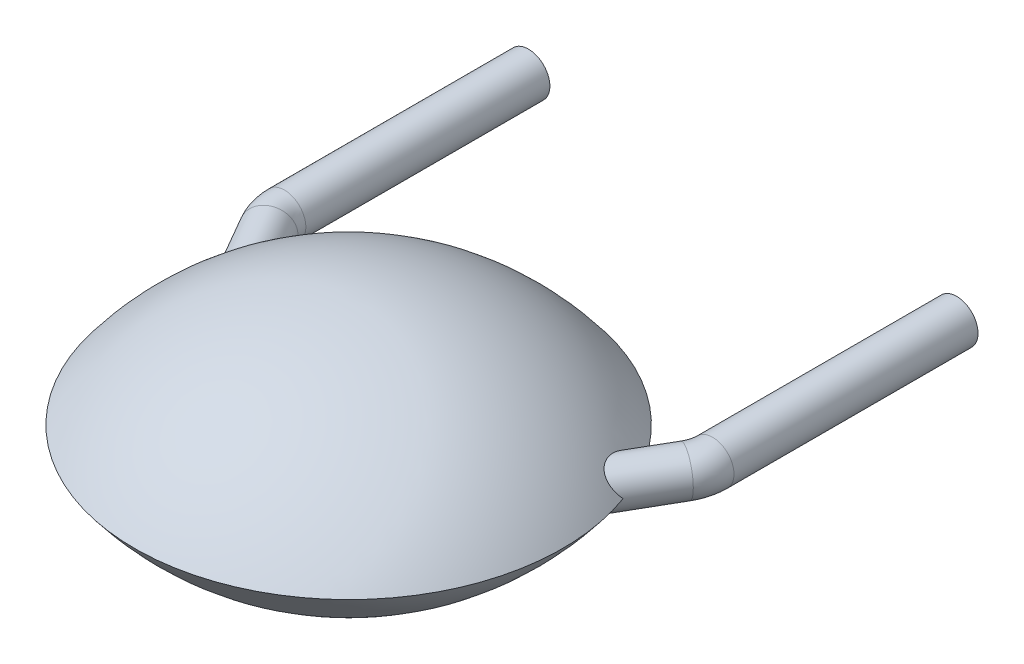
ISO-10303-21;
HEADER;
FILE_DESCRIPTION(('STEP AP214'),'2;1');
FILE_NAME('part.step','',(''),(''),'','','');
FILE_SCHEMA(('AUTOMOTIVE_DESIGN { 1 0 10303 214 1 1 1 1 }'));
ENDSEC;
DATA;
#1=APPLICATION_CONTEXT('core data for automotive mechanical design processes');
#2=APPLICATION_PROTOCOL_DEFINITION('international standard','automotive_design',2000,#1);
#3=PRODUCT_CONTEXT('',#1,'mechanical');
#4=PRODUCT('Part','Part','',(#3));
#5=PRODUCT_RELATED_PRODUCT_CATEGORY('part','',(#4));
#6=PRODUCT_DEFINITION_FORMATION('','',#4);
#7=PRODUCT_DEFINITION_CONTEXT('part definition',#1,'design');
#8=PRODUCT_DEFINITION('design','',#6,#7);
#9=PRODUCT_DEFINITION_SHAPE('','',#8);
#10=(LENGTH_UNIT() NAMED_UNIT(*) SI_UNIT(.MILLI.,.METRE.));
#11=(NAMED_UNIT(*) PLANE_ANGLE_UNIT() SI_UNIT($,.RADIAN.));
#12=(NAMED_UNIT(*) SI_UNIT($,.STERADIAN.) SOLID_ANGLE_UNIT());
#13=UNCERTAINTY_MEASURE_WITH_UNIT(LENGTH_MEASURE(1.E-05),#10,'distance_accuracy_value','');
#14=(GEOMETRIC_REPRESENTATION_CONTEXT(3) GLOBAL_UNCERTAINTY_ASSIGNED_CONTEXT((#13)) GLOBAL_UNIT_ASSIGNED_CONTEXT((#10,
#11,#12)) REPRESENTATION_CONTEXT('',''));
#15=CARTESIAN_POINT('',(0.,0.,0.));
#16=DIRECTION('',(0.,0.,1.));
#17=DIRECTION('',(1.,0.,0.));
#18=AXIS2_PLACEMENT_3D('',#15,#16,#17);
#19=CARTESIAN_POINT('',(-0.255,-0.25,-2.));
#20=DIRECTION('',(0.,0.,-1.));
#21=DIRECTION('',(0.,1.,0.));
#22=AXIS2_PLACEMENT_3D('',#19,#20,#21);
#23=PLANE('',#22);
#24=CARTESIAN_POINT('',(0.,1.26567051110527E-13,-2.));
#25=DIRECTION('',(0.,0.,-1.));
#26=DIRECTION('',(-1.,0.,0.));
#27=AXIS2_PLACEMENT_3D('',#24,#25,#26);
#28=CIRCLE('',#27,0.249999999999979);
#29=CARTESIAN_POINT('',(-0.249999999999979,1.26567051110527E-13,-2.));
#30=VERTEX_POINT('',#29);
#31=EDGE_CURVE('E22',#30,#30,#28,.F.);
#32=ORIENTED_EDGE('',*,*,#31,.F.);
#33=EDGE_LOOP('',(#32));
#34=FACE_BOUND('',#33,.T.);
#35=ADVANCED_FACE('F17',(#34),#23,.T.);
#36=CARTESIAN_POINT('',(5.255,0.25,-2.));
#37=DIRECTION('',(0.,0.,-1.));
#38=DIRECTION('',(0.,-1.,0.));
#39=AXIS2_PLACEMENT_3D('',#36,#37,#38);
#40=PLANE('',#39);
#41=CARTESIAN_POINT('',(5.,-1.26567051110527E-13,-2.));
#42=DIRECTION('',(0.,0.,-1.));
#43=DIRECTION('',(-1.,0.,0.));
#44=AXIS2_PLACEMENT_3D('',#41,#42,#43);
#45=CIRCLE('',#44,0.249999999999979);
#46=CARTESIAN_POINT('',(4.75000000000002,-1.26567051110527E-13,-2.));
#47=VERTEX_POINT('',#46);
#48=EDGE_CURVE('E72',#47,#47,#45,.F.);
#49=ORIENTED_EDGE('',*,*,#48,.F.);
#50=EDGE_LOOP('',(#49));
#51=FACE_BOUND('',#50,.T.);
#52=ADVANCED_FACE('F104',(#51),#40,.T.);
#53=CARTESIAN_POINT('',(0.,1.26567051110527E-13,0.85));
#54=DIRECTION('',(0.,0.,-1.));
#55=DIRECTION('',(-1.,0.,0.));
#56=AXIS2_PLACEMENT_3D('',#53,#54,#55);
#57=CYLINDRICAL_SURFACE('',#56,0.249999999999979);
#58=CARTESIAN_POINT('',(0.,1.26783891545024E-13,0.85));
#59=DIRECTION('',(0.,0.,-1.));
#60=DIRECTION('',(-1.,0.,0.));
#61=AXIS2_PLACEMENT_3D('',#58,#59,#60);
#62=CIRCLE('',#61,0.249999999999979);
#63=CARTESIAN_POINT('',(-0.249999999999979,1.26783891545024E-13,0.85));
#64=VERTEX_POINT('',#63);
#65=EDGE_CURVE('E70',#64,#64,#62,.T.);
#66=ORIENTED_EDGE('',*,*,#65,.T.);
#67=EDGE_LOOP('',(#66));
#68=FACE_BOUND('',#67,.T.);
#69=ORIENTED_EDGE('',*,*,#31,.T.);
#70=EDGE_LOOP('',(#69));
#71=FACE_BOUND('',#70,.T.);
#72=ADVANCED_FACE('F101',(#68,#71),#57,.T.);
#73=CARTESIAN_POINT('',(5.,-1.26567051110527E-13,0.85));
#74=DIRECTION('',(0.,0.,-1.));
#75=DIRECTION('',(-1.,0.,0.));
#76=AXIS2_PLACEMENT_3D('',#73,#74,#75);
#77=CYLINDRICAL_SURFACE('',#76,0.249999999999979);
#78=CARTESIAN_POINT('',(5.,-1.26567051110527E-13,0.85));
#79=DIRECTION('',(0.,0.,-1.));
#80=DIRECTION('',(-1.,0.,0.));
#81=AXIS2_PLACEMENT_3D('',#78,#79,#80);
#82=CIRCLE('',#81,0.249999999999979);
#83=CARTESIAN_POINT('',(5.24999999999998,-1.26567051110527E-13,0.85));
#84=VERTEX_POINT('',#83);
#85=EDGE_CURVE('E67',#84,#84,#82,.T.);
#86=ORIENTED_EDGE('',*,*,#85,.T.);
#87=EDGE_LOOP('',(#86));
#88=FACE_BOUND('',#87,.T.);
#89=ORIENTED_EDGE('',*,*,#48,.T.);
#90=EDGE_LOOP('',(#89));
#91=FACE_BOUND('',#90,.T.);
#92=ADVANCED_FACE('F143',(#88,#91),#77,.T.);
#93=CARTESIAN_POINT('',(0.499999999998368,1.26783891545024E-13,0.85));
#94=DIRECTION('',(0.,1.,0.));
#95=DIRECTION('',(0.,0.,1.));
#96=AXIS2_PLACEMENT_3D('',#93,#94,#95);
#97=TOROIDAL_SURFACE('',#96,0.499999999998368,0.249999999999979);
#98=CARTESIAN_POINT('',(0.0669872981077983,1.41637461308075E-13,1.10000000000003));
#99=DIRECTION('',(0.50000000000003,-1.46384386899602E-13,0.866025403784421));
#100=DIRECTION('',(0.866025403784421,0.,-0.50000000000003));
#101=AXIS2_PLACEMENT_3D('',#98,#99,#100);
#102=CIRCLE('',#101,0.24999999999994);
#103=CARTESIAN_POINT('',(-0.14951905283789,1.49064246189615E-13,1.22500000000028));
#104=VERTEX_POINT('',#103);
#105=EDGE_CURVE('E64',#104,#104,#102,.T.);
#106=CARTESIAN_POINT('',(0.499999999998368,1.26783891545024E-13,0.85));
#107=DIRECTION('',(0.,1.,0.));
#108=DIRECTION('',(0.,0.,1.));
#109=AXIS2_PLACEMENT_3D('',#106,#107,#108);
#110=CIRCLE('',#109,0.749999999998347);
#111=EDGE_CURVE('',#64,#104,#110,.T.);
#112=ORIENTED_EDGE('',*,*,#65,.F.);
#113=ORIENTED_EDGE('',*,*,#105,.F.);
#114=ORIENTED_EDGE('',*,*,#111,.T.);
#115=ORIENTED_EDGE('',*,*,#111,.F.);
#116=EDGE_LOOP('',(#112,#114,#113,#115));
#117=FACE_BOUND('',#116,.T.);
#118=ADVANCED_FACE('F136',(#117),#97,.T.);
#119=CARTESIAN_POINT('',(4.50000000000283,-1.26567051110527E-13,0.85));
#120=DIRECTION('',(0.,-1.,0.));
#121=DIRECTION('',(0.,0.,-1.));
#122=AXIS2_PLACEMENT_3D('',#119,#120,#121);
#123=TOROIDAL_SURFACE('',#122,0.499999999997168,0.249999999999979);
#124=CARTESIAN_POINT('',(4.933012701892,0.,1.1));
#125=DIRECTION('',(-0.49999999999981,0.,0.866025403784548));
#126=DIRECTION('',(0.866025403784548,0.,0.49999999999981));
#127=AXIS2_PLACEMENT_3D('',#124,#125,#126);
#128=CIRCLE('',#127,0.249999999999994);
#129=CARTESIAN_POINT('',(5.14951905283755,0.,1.22500000000055));
#130=VERTEX_POINT('',#129);
#131=EDGE_CURVE('E61',#130,#130,#128,.T.);
#132=CARTESIAN_POINT('',(4.50000000000283,-1.26567051110527E-13,0.85));
#133=DIRECTION('',(0.,-1.,0.));
#134=DIRECTION('',(0.,0.,-1.));
#135=AXIS2_PLACEMENT_3D('',#132,#133,#134);
#136=CIRCLE('',#135,0.749999999997148);
#137=EDGE_CURVE('',#84,#130,#136,.T.);
#138=ORIENTED_EDGE('',*,*,#85,.F.);
#139=ORIENTED_EDGE('',*,*,#131,.F.);
#140=ORIENTED_EDGE('',*,*,#137,.T.);
#141=ORIENTED_EDGE('',*,*,#137,.F.);
#142=EDGE_LOOP('',(#138,#140,#139,#141));
#143=FACE_BOUND('',#142,.T.);
#144=ADVANCED_FACE('F130',(#143),#123,.T.);
#145=CARTESIAN_POINT('',(0.435698502092075,-1.66316613259276E-13,1.7386265386199));
#146=DIRECTION('',(-0.499999999999414,2.61429800100165E-13,-0.866025403784777));
#147=DIRECTION('',(-0.866025403784777,0.,0.499999999999414));
#148=AXIS2_PLACEMENT_3D('',#145,#146,#147);
#149=CYLINDRICAL_SURFACE('',#148,0.249999999999963);
#150=CARTESIAN_POINT('',(0.420502910737576,2.43781572211934E-13,1.2123070023423));
#151=CARTESIAN_POINT('',(0.427296219715295,0.0162845767891927,1.22412882817289));
#152=CARTESIAN_POINT('',(0.433049588219869,0.0319882813711467,1.23721348943219));
#153=CARTESIAN_POINT('',(0.442658773689037,0.0620392097038021,1.26534862328763));
#154=CARTESIAN_POINT('',(0.446523142303179,0.0763923045999827,1.28038983885689));
#155=CARTESIAN_POINT('',(0.453928152226553,0.109693849902198,1.3189348092324));
#156=CARTESIAN_POINT('',(0.456581447593014,0.127892474357019,1.34325424188633));
#157=CARTESIAN_POINT('',(0.458776711517447,0.161180755556295,1.39420875338534));
#158=CARTESIAN_POINT('',(0.458303433790067,0.176254807333498,1.42085455331447));
#159=CARTESIAN_POINT('',(0.454248144565577,0.202948915781051,1.47589945233532));
#160=CARTESIAN_POINT('',(0.450638190432433,0.21453666265224,1.5043121737824));
#161=CARTESIAN_POINT('',(0.440001022368547,0.233378826887958,1.56187444991464));
#162=CARTESIAN_POINT('',(0.432990228372812,0.240653696416607,1.59101983248939));
#163=CARTESIAN_POINT('',(0.419481002436585,0.247301591775329,1.63401576710726));
#164=CARTESIAN_POINT('',(0.414565196264359,0.248813772338325,1.64804143540743));
#165=CARTESIAN_POINT('',(0.403595252563461,0.250247014804036,1.67573885531674));
#166=CARTESIAN_POINT('',(0.397542064064095,0.250169397440489,1.68941089125316));
#167=CARTESIAN_POINT('',(0.385482198479669,0.248292412490526,1.7133143417489));
#168=CARTESIAN_POINT('',(0.379707313104238,0.246839735955416,1.72368788024459));
#169=CARTESIAN_POINT('',(0.367269965621471,0.242488214692803,1.74356970929103));
#170=CARTESIAN_POINT('',(0.360609026280383,0.239591828164937,1.75307943821868));
#171=CARTESIAN_POINT('',(0.348030715442077,0.233018863170264,1.76873902638242));
#172=CARTESIAN_POINT('',(0.342286046099303,0.229667036179652,1.77516227567853));
#173=CARTESIAN_POINT('',(0.330361553528092,0.221968321065939,1.78691784570143));
#174=CARTESIAN_POINT('',(0.324182140151103,0.217622361674883,1.79225117589558));
#175=CARTESIAN_POINT('',(0.311511513918165,0.207975445395952,1.80160030227434));
#176=CARTESIAN_POINT('',(0.3050190195998,0.20267026651646,1.80561004290417));
#177=CARTESIAN_POINT('',(0.291960229562918,0.19128425618693,1.81212917396089));
#178=CARTESIAN_POINT('',(0.285393912885155,0.185203199109004,1.81463812674175));
#179=CARTESIAN_POINT('',(0.272808636299522,0.172894013502135,1.81804792018709));
#180=CARTESIAN_POINT('',(0.266781153856267,0.166698955484541,1.81903964458246));
#181=CARTESIAN_POINT('',(0.254979372360112,0.154012328962483,1.81981306754024));
#182=CARTESIAN_POINT('',(0.24920503966043,0.147520800098322,1.8195949274033));
#183=CARTESIAN_POINT('',(0.235088597227145,0.130991092064177,1.81771259566988));
#184=CARTESIAN_POINT('',(0.226958392821098,0.120850717724047,1.81536052879669));
#185=CARTESIAN_POINT('',(0.211529391687446,0.10050212129821,1.80873878959823));
#186=CARTESIAN_POINT('',(0.204235895165045,0.0902938582888499,1.8044576575336));
#187=CARTESIAN_POINT('',(0.187974881579896,0.0662727815561576,1.79256410886977));
#188=CARTESIAN_POINT('',(0.17939045109531,0.0525280355079195,1.78430503410234));
#189=CARTESIAN_POINT('',(0.163897022372428,0.0257509809041539,1.7659046136209));
#190=CARTESIAN_POINT('',(0.156962547687713,0.0127106279055963,1.7557968356982));
#191=CARTESIAN_POINT('',(0.150731935252958,0.,1.74504996639581));
#192=B_SPLINE_CURVE_WITH_KNOTS('',3,(#150,#151,#152,#153,#154,#155,#156,#157,#158,#159,#160,
#161,#162,#163,#164,#165,#166,#167,#168,#169,#170,#171,#172,#173,#174,#175,#176,#177,#178,#179,
#180,#181,#182,#183,#184,#185,#186,#187,#188,#189,#190,#191),.UNSPECIFIED.,.F.,.F.,(4,2,2,2,2,2,
2,2,2,2,2,2,2,2,2,2,2,2,2,2,4),(0.,0.0635331954129444,0.126776044207702,0.217790749747054,
0.30924960194023,0.401531653649358,0.493372518243978,0.538092917943628,0.582776167422959,
0.618542235723022,0.654247612239325,0.681875164105749,0.709477010589424,0.737203442375159,
0.764937955552852,0.790935261557959,0.816929101653333,0.856331374269617,0.895970869305673,
0.95031941684207,1.00376461364986),.UNSPECIFIED.);
#193=CARTESIAN_POINT('',(0.420502910737557,4.14835717071058E-13,1.21230700234227));
#194=VERTEX_POINT('',#193);
#195=CARTESIAN_POINT('',(0.150731935253,0.,1.74504996639589));
#196=VERTEX_POINT('',#195);
#197=EDGE_CURVE('E45',#194,#196,#192,.T.);
#198=ORIENTED_EDGE('',*,*,#197,.F.);
#199=CARTESIAN_POINT('',(0.150731935253043,-1.51601315917177E-13,1.74504996639596));
#200=CARTESIAN_POINT('',(0.15806954611042,-0.0149620895713384,1.75768030202348));
#201=CARTESIAN_POINT('',(0.166408260218837,-0.0304360475435958,1.76949406617794));
#202=CARTESIAN_POINT('',(0.185351820298401,-0.0622668893354972,1.79038408883657));
#203=CARTESIAN_POINT('',(0.195992273599594,-0.078634218759841,1.79941119672932));
#204=CARTESIAN_POINT('',(0.213952224200793,-0.103737102356063,1.80985045374757));
#205=CARTESIAN_POINT('',(0.220440053552874,-0.112395102234937,1.81284177090282));
#206=CARTESIAN_POINT('',(0.234004979953423,-0.129596410206035,1.81730669948078));
#207=CARTESIAN_POINT('',(0.241079279843303,-0.13814005988165,1.81878711239551));
#208=CARTESIAN_POINT('',(0.254650670008347,-0.153661350784662,1.81983676220569));
#209=CARTESIAN_POINT('',(0.261076575072666,-0.160682564593133,1.81965802524134));
#210=CARTESIAN_POINT('',(0.274178822328836,-0.1742892945164,1.81779260094959));
#211=CARTESIAN_POINT('',(0.280855103200754,-0.180874916234801,1.81610628056584));
#212=CARTESIAN_POINT('',(0.294298915903355,-0.193397995656089,1.81112196349096));
#213=CARTESIAN_POINT('',(0.301066750337812,-0.199331573683684,1.80781489853012));
#214=CARTESIAN_POINT('',(0.314413111043317,-0.2102772238903,1.79965949351168));
#215=CARTESIAN_POINT('',(0.320991673498804,-0.215289473206862,1.79481145021763));
#216=CARTESIAN_POINT('',(0.333156360571336,-0.223846296378655,1.78432058478773));
#217=CARTESIAN_POINT('',(0.33877796050642,-0.2274838334709,1.77879304091472));
#218=CARTESIAN_POINT('',(0.349600279317899,-0.233886173997783,1.76688520756088));
#219=CARTESIAN_POINT('',(0.354800595967075,-0.236650150522157,1.7605041181977));
#220=CARTESIAN_POINT('',(0.367132935910447,-0.242479461710537,1.7438758251533));
#221=CARTESIAN_POINT('',(0.373986378414887,-0.24504675900636,1.73324875134983));
#222=CARTESIAN_POINT('',(0.386676583557054,-0.248594694405834,1.71118048875771));
#223=CARTESIAN_POINT('',(0.392513167662589,-0.249575054137183,1.69973915750366));
#224=CARTESIAN_POINT('',(0.399171405921405,-0.249963145158717,1.68529493164576));
#225=CARTESIAN_POINT('',(0.400430845280958,-0.249999868144704,1.68249279366292));
#226=CARTESIAN_POINT('',(0.410170171514745,-0.250000908576796,1.66028996288526));
#227=CARTESIAN_POINT('',(0.417480530078367,-0.248264403962789,1.64034740045277));
#228=CARTESIAN_POINT('',(0.430112798780412,-0.242091077068235,1.60021281336386));
#229=CARTESIAN_POINT('',(0.435423619948609,-0.237639544531407,1.58002002094815));
#230=CARTESIAN_POINT('',(0.446059898883705,-0.224332103335323,1.53199406797519));
#231=CARTESIAN_POINT('',(0.45057550494834,-0.214433828209805,1.50426781569254));
#232=CARTESIAN_POINT('',(0.45663303127901,-0.191086861637678,1.4500238697383));
#233=CARTESIAN_POINT('',(0.45817231945859,-0.177635039572025,1.42350726602322));
#234=CARTESIAN_POINT('',(0.458328544441145,-0.14730462814592,1.37183021729293));
#235=CARTESIAN_POINT('',(0.456890532089956,-0.130366894914173,1.34670421839331));
#236=CARTESIAN_POINT('',(0.450766785400387,-0.0935493676236361,1.29923607991746));
#237=CARTESIAN_POINT('',(0.446094848658999,-0.0736823537312818,1.27688258737583));
#238=CARTESIAN_POINT('',(0.437006749266394,-0.0441553948540505,1.24845703285718));
#239=CARTESIAN_POINT('',(0.434146456062461,-0.0355934504470034,1.24071777392444));
#240=CARTESIAN_POINT('',(0.42780308788909,-0.018080424486355,1.22595028774227));
#241=CARTESIAN_POINT('',(0.42431936339637,-0.00912894452698345,1.21892281414169));
#242=CARTESIAN_POINT('',(0.420502910737576,-2.44253646934862E-13,1.2123070023423));
#243=B_SPLINE_CURVE_WITH_KNOTS('',3,(#199,#200,#201,#202,#203,#204,#205,#206,#207,#208,#209,
#210,#211,#212,#213,#214,#215,#216,#217,#218,#219,#220,#221,#222,#223,#224,#225,#226,#227,#228,
#229,#230,#231,#232,#233,#234,#235,#236,#237,#238,#239,#240,#241,#242),.UNSPECIFIED.,.F.,.F.,(4,
2,2,2,2,2,2,2,2,2,2,2,2,2,2,2,2,2,2,2,2,4),(0.,0.0630548205121394,0.127165464985863,
0.160744649437195,0.194171997948382,0.222615770617747,0.251052621997505,0.279650429600485,
0.308242733135355,0.334185515792374,0.36015278277788,0.39864894503624,0.437151859358882,
0.446369113545179,0.509882490921069,0.573743084570705,0.662629445167272,0.751594375924618,
0.842215872314411,0.932453094536889,0.968087316367283,1.00375888225339),.UNSPECIFIED.);
#244=EDGE_CURVE('E53',#196,#194,#243,.T.);
#245=ORIENTED_EDGE('',*,*,#244,.F.);
#246=EDGE_LOOP('',(#198,#245));
#247=FACE_BOUND('',#246,.T.);
#248=ORIENTED_EDGE('',*,*,#105,.T.);
#249=EDGE_LOOP('',(#248));
#250=FACE_BOUND('',#249,.T.);
#251=ADVANCED_FACE('F54',(#247,#250),#149,.T.);
#252=CARTESIAN_POINT('',(4.56430149790796,0.,1.73862653861883));
#253=DIRECTION('',(0.49999999999981,0.,-0.866025403784548));
#254=DIRECTION('',(-0.866025403784548,0.,-0.49999999999981));
#255=AXIS2_PLACEMENT_3D('',#252,#253,#254);
#256=CYLINDRICAL_SURFACE('',#255,0.249999999999995);
#257=CARTESIAN_POINT('',(4.84926806474669,3.23523967810156E-13,1.74504996639561));
#258=CARTESIAN_POINT('',(4.8419304538893,0.0149620895715236,1.75768030202311));
#259=CARTESIAN_POINT('',(4.83359173978086,0.0304360475437957,1.76949406617753));
#260=CARTESIAN_POINT('',(4.81464817970125,0.062266889335724,1.79038408883611));
#261=CARTESIAN_POINT('',(4.80400772640003,0.0786342187600801,1.79941119672882));
#262=CARTESIAN_POINT('',(4.7860477757988,0.103737102356303,1.809850453747));
#263=CARTESIAN_POINT('',(4.77955994644671,0.11239510223517,1.81284177090222));
#264=CARTESIAN_POINT('',(4.76599502004616,0.12959641020625,1.81730669948011));
#265=CARTESIAN_POINT('',(4.75892072015628,0.138140059881855,1.81878711239482));
#266=CARTESIAN_POINT('',(4.74534932999123,0.153661350784846,1.81983676220494));
#267=CARTESIAN_POINT('',(4.7389234249269,0.160682564593309,1.81965802524057));
#268=CARTESIAN_POINT('',(4.72582117767073,0.174289294516553,1.81779260094876));
#269=CARTESIAN_POINT('',(4.71914489679881,0.180874916234942,1.81610628056498));
#270=CARTESIAN_POINT('',(4.70570108409622,0.193397995656201,1.81112196349006));
#271=CARTESIAN_POINT('',(4.69893324966176,0.19933157368378,1.80781489852919));
#272=CARTESIAN_POINT('',(4.68558688895627,0.210277223890363,1.79965949351072));
#273=CARTESIAN_POINT('',(4.67900832650079,0.215289473206908,1.79481145021664));
#274=CARTESIAN_POINT('',(4.66684363942826,0.223846296378676,1.78432058478671));
#275=CARTESIAN_POINT('',(4.66122203949318,0.227483833470911,1.77879304091369));
#276=CARTESIAN_POINT('',(4.65039972068169,0.233886173997775,1.76688520755981));
#277=CARTESIAN_POINT('',(4.64519940403252,0.236650150522138,1.76050411819661));
#278=CARTESIAN_POINT('',(4.63286706408914,0.242479461710495,1.74387582515215));
#279=CARTESIAN_POINT('',(4.62601362158469,0.245046759006304,1.73324875134864));
#280=CARTESIAN_POINT('',(4.61332341644251,0.248594694405742,1.71118048875645));
#281=CARTESIAN_POINT('',(4.60748683233697,0.249575054137072,1.69973915750237));
#282=CARTESIAN_POINT('',(4.60082859407832,0.24996314515857,1.68529493164478));
#283=CARTESIAN_POINT('',(4.59956915471892,0.249999868144552,1.68249279366229));
#284=CARTESIAN_POINT('',(4.58982982848525,0.250000908576675,1.66028996288498));
#285=CARTESIAN_POINT('',(4.58251946992161,0.248264403962689,1.64034740045249));
#286=CARTESIAN_POINT('',(4.56988720121952,0.242091077068169,1.60021281336358));
#287=CARTESIAN_POINT('',(4.5645763800513,0.237639544531354,1.58002002094787));
#288=CARTESIAN_POINT('',(4.55394010111619,0.22433210333531,1.53199406797495));
#289=CARTESIAN_POINT('',(4.54942449505154,0.214433828209825,1.50426781569236));
#290=CARTESIAN_POINT('',(4.54336696872084,0.191086861637775,1.45002386973822));
#291=CARTESIAN_POINT('',(4.54182768054125,0.177635039572163,1.42350726602318));
#292=CARTESIAN_POINT('',(4.54167145555866,0.147304628146148,1.37183021729297));
#293=CARTESIAN_POINT('',(4.54310946790982,0.13036689491445,1.3467042183934));
#294=CARTESIAN_POINT('',(4.54923321459934,0.0935493676240169,1.2992360799176));
#295=CARTESIAN_POINT('',(4.55390515134069,0.073682353731718,1.276882587376));
#296=CARTESIAN_POINT('',(4.56299325073326,0.0441553948544832,1.24845703285727));
#297=CARTESIAN_POINT('',(4.56585354393721,0.0355934504473703,1.24071777392445));
#298=CARTESIAN_POINT('',(4.57219691211062,0.0180804244865834,1.22595028774215));
#299=CARTESIAN_POINT('',(4.57568063660337,0.00912894452713893,1.2189228141415));
#300=CARTESIAN_POINT('',(4.57949708926219,3.23592748713756E-13,1.21230700234206));
#301=B_SPLINE_CURVE_WITH_KNOTS('',3,(#257,#258,#259,#260,#261,#262,#263,#264,#265,#266,#267,
#268,#269,#270,#271,#272,#273,#274,#275,#276,#277,#278,#279,#280,#281,#282,#283,#284,#285,#286,
#287,#288,#289,#290,#291,#292,#293,#294,#295,#296,#297,#298,#299,#300),.UNSPECIFIED.,.F.,.F.,(4,
2,2,2,2,2,2,2,2,2,2,2,2,2,2,2,2,2,2,2,2,4),(0.,0.0630548205121525,0.127165464985891,
0.160744649437192,0.194171997948346,0.222615770617698,0.251052621997444,0.279650429600409,
0.308242733135265,0.334185515792313,0.360152782777849,0.398648945036305,0.43715185935904,
0.446369113544199,0.509882490920105,0.573743084569757,0.662629445166146,0.751594375923312,
0.842215872312934,0.932453094535244,0.968087316365935,1.00375888225233),.UNSPECIFIED.);
#302=CARTESIAN_POINT('',(4.8492680647468,1.62246097529794E-13,1.74504996639542));
#303=VERTEX_POINT('',#302);
#304=CARTESIAN_POINT('',(4.57949708926219,0.,1.21230700234206));
#305=VERTEX_POINT('',#304);
#306=EDGE_CURVE('E34',#303,#305,#301,.T.);
#307=ORIENTED_EDGE('',*,*,#306,.F.);
#308=CARTESIAN_POINT('',(4.57949708926219,-3.22480437350407E-13,1.21230700234205));
#309=CARTESIAN_POINT('',(4.57270378028447,-0.0162845767892753,1.22412882817264));
#310=CARTESIAN_POINT('',(4.56695041177989,-0.0319882813712334,1.23721348943194));
#311=CARTESIAN_POINT('',(4.55734122631071,-0.0620392097038979,1.26534862328737));
#312=CARTESIAN_POINT('',(4.55347685769656,-0.0763923046000835,1.28038983885663));
#313=CARTESIAN_POINT('',(4.54607184777317,-0.109693849902312,1.31893480923213));
#314=CARTESIAN_POINT('',(4.5434185524067,-0.127892474357141,1.34325424188606));
#315=CARTESIAN_POINT('',(4.54122328848225,-0.161180755556435,1.39420875338506));
#316=CARTESIAN_POINT('',(4.54169656620962,-0.176254807333647,1.42085455331419));
#317=CARTESIAN_POINT('',(4.5457518554341,-0.202948915781219,1.47589945233504));
#318=CARTESIAN_POINT('',(4.54936180956724,-0.214536662652418,1.50431217378212));
#319=CARTESIAN_POINT('',(4.55999897763111,-0.233378826888152,1.56187444991436));
#320=CARTESIAN_POINT('',(4.56700977162685,-0.240653696416808,1.59101983248911));
#321=CARTESIAN_POINT('',(4.58051899756307,-0.247301591775536,1.63401576710697));
#322=CARTESIAN_POINT('',(4.58543480373529,-0.248813772338533,1.64804143540712));
#323=CARTESIAN_POINT('',(4.59640474743618,-0.250247014804248,1.67573885531641));
#324=CARTESIAN_POINT('',(4.60245793593554,-0.250169397440704,1.68941089125283));
#325=CARTESIAN_POINT('',(4.61451780151996,-0.248292412490747,1.71331434174855));
#326=CARTESIAN_POINT('',(4.62029268689539,-0.246839735955639,1.72368788024423));
#327=CARTESIAN_POINT('',(4.63273003437816,-0.242488214693032,1.74356970929066));
#328=CARTESIAN_POINT('',(4.63939097371924,-0.239591828165169,1.75307943821831));
#329=CARTESIAN_POINT('',(4.65196928455754,-0.233018863170501,1.76873902638204));
#330=CARTESIAN_POINT('',(4.65771395390032,-0.22966703617989,1.77516227567815));
#331=CARTESIAN_POINT('',(4.66963844647153,-0.22196832106618,1.78691784570105));
#332=CARTESIAN_POINT('',(4.67581785984852,-0.217622361675125,1.79225117589519));
#333=CARTESIAN_POINT('',(4.68848848608146,-0.207975445396197,1.80160030227395));
#334=CARTESIAN_POINT('',(4.69498098039983,-0.202670266516706,1.80561004290379));
#335=CARTESIAN_POINT('',(4.70803977043671,-0.19128425618718,1.81212917396051));
#336=CARTESIAN_POINT('',(4.71460608711448,-0.185203199109256,1.81463812674136));
#337=CARTESIAN_POINT('',(4.72719136370011,-0.172894013502388,1.81804792018671));
#338=CARTESIAN_POINT('',(4.73321884614337,-0.166698955484793,1.81903964458208));
#339=CARTESIAN_POINT('',(4.74502062763953,-0.154012328962732,1.81981306753987));
#340=CARTESIAN_POINT('',(4.75079496033922,-0.147520800098571,1.81959492740292));
#341=CARTESIAN_POINT('',(4.76491140277251,-0.130991092064417,1.81771259566951));
#342=CARTESIAN_POINT('',(4.77304160717857,-0.12085071772428,1.81536052879632));
#343=CARTESIAN_POINT('',(4.78847060831224,-0.100502121298427,1.80873878959786));
#344=CARTESIAN_POINT('',(4.79576410483465,-0.0902938582890589,1.80445765753323));
#345=CARTESIAN_POINT('',(4.81202511841981,-0.0662727815563545,1.7925641088694));
#346=CARTESIAN_POINT('',(4.8206095489044,-0.0525280355081121,1.78430503410197));
#347=CARTESIAN_POINT('',(4.8361029776273,-0.0257509809043369,1.76590461362054));
#348=CARTESIAN_POINT('',(4.84303745231202,-0.0127106279057739,1.75579683569784));
#349=CARTESIAN_POINT('',(4.84926806474678,-1.50097981684972E-13,1.74504996639546));
#350=B_SPLINE_CURVE_WITH_KNOTS('',3,(#308,#309,#310,#311,#312,#313,#314,#315,#316,#317,#318,
#319,#320,#321,#322,#323,#324,#325,#326,#327,#328,#329,#330,#331,#332,#333,#334,#335,#336,#337,
#338,#339,#340,#341,#342,#343,#344,#345,#346,#347,#348,#349),.UNSPECIFIED.,.F.,.F.,(4,2,2,2,2,2,
2,2,2,2,2,2,2,2,2,2,2,2,2,2,4),(0.,0.0635331954129515,0.126776044207718,0.217790749747077,
0.309249601940262,0.401531653649395,0.493372518244018,0.538092917943633,0.582776167422928,
0.618542235722973,0.65424761223926,0.681875164105683,0.709477010589356,0.73720344237509,
0.764937955552781,0.790935261557897,0.81692910165328,0.856331374269598,0.895970869305686,
0.950319416842097,1.0037646136499),.UNSPECIFIED.);
#351=EDGE_CURVE('E11',#305,#303,#350,.T.);
#352=ORIENTED_EDGE('',*,*,#351,.F.);
#353=EDGE_LOOP('',(#307,#352));
#354=FACE_BOUND('',#353,.T.);
#355=ORIENTED_EDGE('',*,*,#131,.T.);
#356=EDGE_LOOP('',(#355));
#357=FACE_BOUND('',#356,.T.);
#358=ADVANCED_FACE('F81',(#354,#357),#256,.T.);
#359=CARTESIAN_POINT('',(2.5,-1.875,2.6));
#360=DIRECTION('',(0.,-1.,0.));
#361=DIRECTION('',(-1.,0.,0.));
#362=AXIS2_PLACEMENT_3D('',#359,#360,#361);
#363=SPHERICAL_SURFACE('',#362,3.12500000000001);
#364=CARTESIAN_POINT('',(2.50000000000011,0.,2.6));
#365=DIRECTION('',(0.,-1.,0.));
#366=DIRECTION('',(0.,0.,-1.));
#367=AXIS2_PLACEMENT_3D('',#364,#365,#366);
#368=CIRCLE('',#367,2.49999999999998);
#369=EDGE_CURVE('E49',#303,#196,#368,.T.);
#370=ORIENTED_EDGE('',*,*,#369,.F.);
#371=ORIENTED_EDGE('',*,*,#306,.T.);
#372=CARTESIAN_POINT('',(2.50000000000011,0.,2.6));
#373=DIRECTION('',(0.,-1.,0.));
#374=DIRECTION('',(0.,0.,-1.));
#375=AXIS2_PLACEMENT_3D('',#372,#373,#374);
#376=CIRCLE('',#375,2.49999999999998);
#377=EDGE_CURVE('E27',#194,#305,#376,.T.);
#378=ORIENTED_EDGE('',*,*,#377,.F.);
#379=ORIENTED_EDGE('',*,*,#197,.T.);
#380=EDGE_LOOP('',(#370,#371,#378,#379));
#381=FACE_BOUND('',#380,.T.);
#382=ADVANCED_FACE('F47',(#381),#363,.T.);
#383=CARTESIAN_POINT('',(2.5,1.875,2.6));
#384=DIRECTION('',(0.,-1.,0.));
#385=DIRECTION('',(-1.,0.,0.));
#386=AXIS2_PLACEMENT_3D('',#383,#384,#385);
#387=SPHERICAL_SURFACE('',#386,3.12500000000001);
#388=ORIENTED_EDGE('',*,*,#351,.T.);
#389=ORIENTED_EDGE('',*,*,#369,.T.);
#390=ORIENTED_EDGE('',*,*,#244,.T.);
#391=ORIENTED_EDGE('',*,*,#377,.T.);
#392=EDGE_LOOP('',(#388,#389,#390,#391));
#393=FACE_BOUND('',#392,.T.);
#394=ADVANCED_FACE('F19',(#393),#387,.T.);
#395=CLOSED_SHELL('',(#35,#52,#72,#92,#118,#144,#251,#358,#382,#394));
#396=MANIFOLD_SOLID_BREP('B1',#395);
#397=ADVANCED_BREP_SHAPE_REPRESENTATION('',(#18,#396),#14);
#398=SHAPE_DEFINITION_REPRESENTATION(#9,#397);
ENDSEC;
END-ISO-10303-21;
